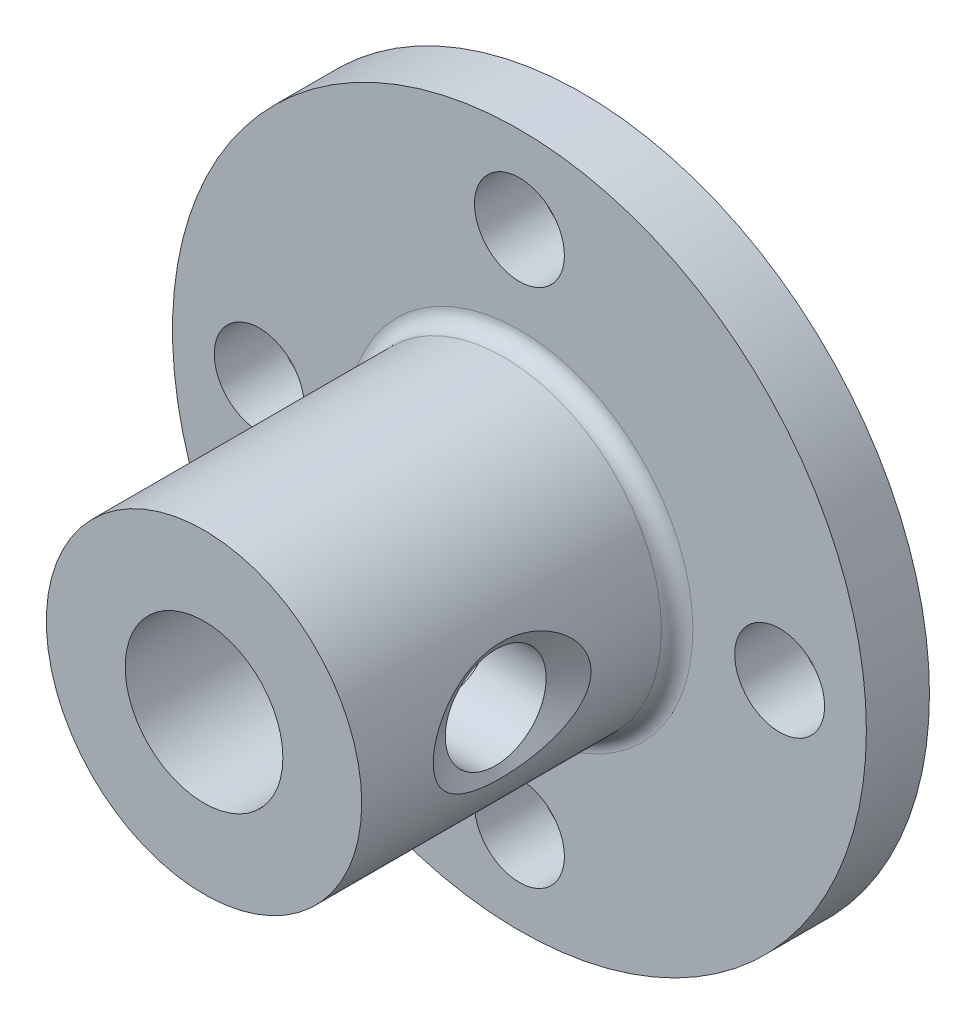
ISO-10303-21;
HEADER;
FILE_DESCRIPTION(('STEP AP214'),'2;1');
FILE_NAME('part.step','',(''),(''),'','','');
FILE_SCHEMA(('AUTOMOTIVE_DESIGN { 1 0 10303 214 1 1 1 1 }'));
ENDSEC;
DATA;
#1=APPLICATION_CONTEXT('core data for automotive mechanical design processes');
#2=APPLICATION_PROTOCOL_DEFINITION('international standard','automotive_design',2000,#1);
#3=PRODUCT_CONTEXT('',#1,'mechanical');
#4=PRODUCT('Part','Part','',(#3));
#5=PRODUCT_RELATED_PRODUCT_CATEGORY('part','',(#4));
#6=PRODUCT_DEFINITION_FORMATION('','',#4);
#7=PRODUCT_DEFINITION_CONTEXT('part definition',#1,'design');
#8=PRODUCT_DEFINITION('design','',#6,#7);
#9=PRODUCT_DEFINITION_SHAPE('','',#8);
#10=(LENGTH_UNIT() NAMED_UNIT(*) SI_UNIT(.MILLI.,.METRE.));
#11=(NAMED_UNIT(*) PLANE_ANGLE_UNIT() SI_UNIT($,.RADIAN.));
#12=(NAMED_UNIT(*) SI_UNIT($,.STERADIAN.) SOLID_ANGLE_UNIT());
#13=UNCERTAINTY_MEASURE_WITH_UNIT(LENGTH_MEASURE(1.E-05),#10,'distance_accuracy_value','');
#14=(GEOMETRIC_REPRESENTATION_CONTEXT(3) GLOBAL_UNCERTAINTY_ASSIGNED_CONTEXT((#13)) GLOBAL_UNIT_ASSIGNED_CONTEXT((#10,
#11,#12)) REPRESENTATION_CONTEXT('',''));
#15=CARTESIAN_POINT('',(0.,0.,0.));
#16=DIRECTION('',(0.,0.,1.));
#17=DIRECTION('',(1.,0.,0.));
#18=AXIS2_PLACEMENT_3D('',#15,#16,#17);
#19=CARTESIAN_POINT('',(0.,0.,12.));
#20=DIRECTION('',(0.,0.,-1.));
#21=DIRECTION('',(-1.,0.,0.));
#22=AXIS2_PLACEMENT_3D('',#19,#20,#21);
#23=CYLINDRICAL_SURFACE('',#22,2.5);
#24=CARTESIAN_POINT('',(-2.5,0.,8.83212387459479));
#25=CARTESIAN_POINT('',(-2.49999528532764,-0.0811257001498167,8.83172341966178));
#26=CARTESIAN_POINT('',(-2.49601279299299,-0.162270470689614,8.82512463907829));
#27=CARTESIAN_POINT('',(-2.48048469101174,-0.321953484441999,8.799897574851));
#28=CARTESIAN_POINT('',(-2.46893076218919,-0.400488760606093,8.78125605947671));
#29=CARTESIAN_POINT('',(-2.43943209795605,-0.552388004803715,8.73304965644872));
#30=CARTESIAN_POINT('',(-2.42151810291221,-0.625774848537303,8.7035372860463));
#31=CARTESIAN_POINT('',(-2.38078230317859,-0.766313801824575,8.63480079092559));
#32=CARTESIAN_POINT('',(-2.35796027221884,-0.833465623727228,8.59557621844331));
#33=CARTESIAN_POINT('',(-2.3070450965382,-0.965911123596261,8.50494480176076));
#34=CARTESIAN_POINT('',(-2.27867165603093,-1.03058784111943,8.45279699232811));
#35=CARTESIAN_POINT('',(-2.22035452830776,-1.150871171846,8.33954738070551));
#36=CARTESIAN_POINT('',(-2.1904086876936,-1.20646489394395,8.27843308211946));
#37=CARTESIAN_POINT('',(-2.12724482174938,-1.3150296728696,8.1388413462037));
#38=CARTESIAN_POINT('',(-2.0941655573832,-1.36650878609703,8.05913065280923));
#39=CARTESIAN_POINT('',(-2.03356450891492,-1.45516526717104,7.89021567888344));
#40=CARTESIAN_POINT('',(-2.00603268966766,-1.49236857182128,7.80102899488721));
#41=CARTESIAN_POINT('',(-1.9675748655886,-1.54251831488213,7.64043197790774));
#42=CARTESIAN_POINT('',(-1.95416704383307,-1.55931502789184,7.57082257586867));
#43=CARTESIAN_POINT('',(-1.93467843197094,-1.58343549358183,7.42902010070153));
#44=CARTESIAN_POINT('',(-1.92858671277118,-1.59077337745315,7.35683104771272));
#45=CARTESIAN_POINT('',(-1.9246594743494,-1.59552444877219,7.2116886257586));
#46=CARTESIAN_POINT('',(-1.92684722502182,-1.59290966359036,7.1387336781318));
#47=CARTESIAN_POINT('',(-1.93917338304728,-1.57787646071465,6.99450502801767));
#48=CARTESIAN_POINT('',(-1.94931856389971,-1.56544969083304,6.92323281116578));
#49=CARTESIAN_POINT('',(-1.97574347158606,-1.53195062989658,6.78592987571592));
#50=CARTESIAN_POINT('',(-1.99186600949792,-1.51109873369579,6.7198133108702));
#51=CARTESIAN_POINT('',(-2.02846896948346,-1.46159476981444,6.59188304187705));
#52=CARTESIAN_POINT('',(-2.04895083381435,-1.43294011976043,6.53007077078407));
#53=CARTESIAN_POINT('',(-2.09680996058701,-1.36218493395521,6.39959180217855));
#54=CARTESIAN_POINT('',(-2.12475128137683,-1.31854863311683,6.33196547226825));
#55=CARTESIAN_POINT('',(-2.18175428088871,-1.22192570728252,6.20420775793231));
#56=CARTESIAN_POINT('',(-2.21081726467822,-1.168927917067,6.14408547117298));
#57=CARTESIAN_POINT('',(-2.2728544731105,-1.04394743226326,6.02208365269237));
#58=CARTESIAN_POINT('',(-2.30559956672106,-0.970264550392063,5.96180997127015));
#59=CARTESIAN_POINT('',(-2.36598348519537,-0.811956490320795,5.85453981443563));
#60=CARTESIAN_POINT('',(-2.39362802231499,-0.727343735647986,5.80752845456604));
#61=CARTESIAN_POINT('',(-2.43594410966984,-0.567096067603944,5.73689474193409));
#62=CARTESIAN_POINT('',(-2.45210753743649,-0.493091038650944,5.71046766194117));
#63=CARTESIAN_POINT('',(-2.47784028608681,-0.340944021843667,5.66861081375687));
#64=CARTESIAN_POINT('',(-2.48741488397657,-0.262805398736681,5.65317224450613));
#65=CARTESIAN_POINT('',(-2.49909190995937,-0.104277753418442,5.63407248080202));
#66=CARTESIAN_POINT('',(-2.50117039381239,-0.0238823451187824,5.63044902996755));
#67=CARTESIAN_POINT('',(-2.49756408255839,0.136370721222933,5.63530404109612));
#68=CARTESIAN_POINT('',(-2.49187865880076,0.216228335193125,5.64378348304382));
#69=CARTESIAN_POINT('',(-2.47375734527055,0.368984213952153,5.67162403183808));
#70=CARTESIAN_POINT('',(-2.46167497799725,0.442030547044343,5.69041699516661));
#71=CARTESIAN_POINT('',(-2.43197449293306,0.5837349513466,5.73760480383412));
#72=CARTESIAN_POINT('',(-2.4143554326288,0.652392273017069,5.76600128404624));
#73=CARTESIAN_POINT('',(-2.37331714411059,0.789210870617883,5.83390513533774));
#74=CARTESIAN_POINT('',(-2.34955543639988,0.856925696974424,5.87410040265875));
#75=CARTESIAN_POINT('',(-2.29881998131915,0.984977120695749,5.96328007368875));
#76=CARTESIAN_POINT('',(-2.27184365854045,1.0453077226384,6.01227154066548));
#77=CARTESIAN_POINT('',(-2.2123134917874,1.16657503415996,6.1261927496278));
#78=CARTESIAN_POINT('',(-2.17953780217481,1.22619202332549,6.19241421575833));
#79=CARTESIAN_POINT('',(-2.11532508241099,1.33391594364428,6.33426281287102));
#80=CARTESIAN_POINT('',(-2.08388823219933,1.38202133163005,6.40989120281895));
#81=CARTESIAN_POINT('',(-2.0302203271573,1.45948579917374,6.55811444738196));
#82=CARTESIAN_POINT('',(-2.00731544730974,1.49054914305566,6.62956899263356));
#83=CARTESIAN_POINT('',(-1.96785238413523,1.54227803497828,6.77778325187809));
#84=CARTESIAN_POINT('',(-1.95128517871595,1.56295837711046,6.85453523936672));
#85=CARTESIAN_POINT('',(-1.92692250102793,1.59291004958125,7.01242224464583));
#86=CARTESIAN_POINT('',(-1.91920875214569,1.60207515865963,7.09359096589892));
#87=CARTESIAN_POINT('',(-1.91436314348674,1.60786666509709,7.25667306804846));
#88=CARTESIAN_POINT('',(-1.9172245996375,1.60450098254987,7.33858594594739));
#89=CARTESIAN_POINT('',(-1.93180423987997,1.58689153945899,7.48863954710057));
#90=CARTESIAN_POINT('',(-1.94223117953252,1.57423082441318,7.5571073973512));
#91=CARTESIAN_POINT('',(-1.96904004052971,1.54056570886488,7.69075518859283));
#92=CARTESIAN_POINT('',(-1.98542764090042,1.5195533495475,7.75593192630584));
#93=CARTESIAN_POINT('',(-2.02890076089363,1.46126520624875,7.90412444748925));
#94=CARTESIAN_POINT('',(-2.05772314680492,1.42087139014034,7.98540246744105));
#95=CARTESIAN_POINT('',(-2.11897947358059,1.3277928750901,8.13911541263695));
#96=CARTESIAN_POINT('',(-2.15141890800696,1.27508934356351,8.21153652643995));
#97=CARTESIAN_POINT('',(-2.21680979707969,1.15772357365444,8.34740746312825));
#98=CARTESIAN_POINT('',(-2.24976274380636,1.09292619418879,8.4107399764446));
#99=CARTESIAN_POINT('',(-2.31263029060745,0.952695922198671,8.52609374476496));
#100=CARTESIAN_POINT('',(-2.34254786741452,0.877273626201766,8.57812613985564));
#101=CARTESIAN_POINT('',(-2.39286369456269,0.727719449138458,8.66309520272136));
#102=CARTESIAN_POINT('',(-2.41399958940981,0.654759652186082,8.6976538597646));
#103=CARTESIAN_POINT('',(-2.45007752841695,0.503149623769568,8.75563945935023));
#104=CARTESIAN_POINT('',(-2.46502969362768,0.424508940198864,8.77908460090545));
#105=CARTESIAN_POINT('',(-2.484014557395,0.287918235005646,8.80847225293373));
#106=CARTESIAN_POINT('',(-2.48998147151682,0.230895303604966,8.81756268129504));
#107=CARTESIAN_POINT('',(-2.49797606447772,0.115918218675103,8.82953184925064));
#108=CARTESIAN_POINT('',(-2.5000033686139,0.0579639770959529,8.83240999798752));
#109=CARTESIAN_POINT('',(-2.5,0.,8.83212387459479));
#110=B_SPLINE_CURVE_WITH_KNOTS('',3,(#24,#25,#26,#27,#28,#29,#30,#31,#32,#33,#34,#35,#36,#37,
#38,#39,#40,#41,#42,#43,#44,#45,#46,#47,#48,#49,#50,#51,#52,#53,#54,#55,#56,#57,#58,#59,#60,#61,
#62,#63,#64,#65,#66,#67,#68,#69,#70,#71,#72,#73,#74,#75,#76,#77,#78,#79,#80,#81,#82,#83,#84,#85,
#86,#87,#88,#89,#90,#91,#92,#93,#94,#95,#96,#97,#98,#99,#100,#101,#102,#103,#104,#105,#106,#107,
#108,#109),.UNSPECIFIED.,.T.,.F.,(4,2,2,2,2,2,2,2,2,2,2,2,2,2,2,2,2,2,2,2,2,2,2,2,2,2,2,2,2,2,2,
2,2,2,2,2,2,2,2,2,2,2,4),(0.,0.243144665339784,0.486556936763848,0.728808381245611,
0.971070996384243,1.2334437480446,1.49618569876053,1.79621607087878,2.09569872651867,
2.31335601731847,2.5306877567105,2.7486307716495,2.96675950497226,3.17951768018675,
3.39234635489934,3.64700259486389,3.90196463349041,4.20248765838711,4.50267204868546,
4.7423280630508,4.98179191237941,5.22201998789947,5.46226751605713,5.69044406504366,
5.91865947767216,6.16447188774905,6.410482572976,6.69413531545825,6.97782606123672,
7.22053079666751,7.46288872883534,7.70746623850406,7.95188918907473,8.16221396747096,
8.37273966018642,8.65692872471713,8.94155545029175,9.22957710072672,9.51731350639453,
9.76663466706735,10.015546127559,10.189255463946,10.3629813213097),.UNSPECIFIED.);
#111=CARTESIAN_POINT('',(-2.5,0.,8.83212387459479));
#112=VERTEX_POINT('',#111);
#113=EDGE_CURVE('E41',#112,#112,#110,.T.);
#114=ORIENTED_EDGE('',*,*,#113,.F.);
#115=EDGE_LOOP('',(#114));
#116=FACE_BOUND('',#115,.T.);
#117=CARTESIAN_POINT('',(1.92591888402043,1.59400014183609,7.23214287927517));
#118=CARTESIAN_POINT('',(1.92593088661887,1.59399277416263,7.15309104712007));
#119=CARTESIAN_POINT('',(1.93087009731857,1.58807538039552,7.07397385388615));
#120=CARTESIAN_POINT('',(1.94972280385169,1.56485954766044,6.9184857173291));
#121=CARTESIAN_POINT('',(1.96365362304423,1.54753913819124,6.84212037626031));
#122=CARTESIAN_POINT('',(1.99809032627638,1.50280266236082,6.694824671056));
#123=CARTESIAN_POINT('',(2.01853789389167,1.47547582907761,6.6238527672222));
#124=CARTESIAN_POINT('',(2.06359653594062,1.41176827142799,6.487580154387));
#125=CARTESIAN_POINT('',(2.08820848452979,1.37538564538087,6.42228064045542));
#126=CARTESIAN_POINT('',(2.14300360151862,1.28861307585258,6.28906641955012));
#127=CARTESIAN_POINT('',(2.17348226036054,1.23696942448552,6.22208968124221));
#128=CARTESIAN_POINT('',(2.23414734193041,1.1237087221977,6.0969337200801));
#129=CARTESIAN_POINT('',(2.26433348495683,1.06208296522801,6.03876226334717));
#130=CARTESIAN_POINT('',(2.32558978465042,0.921017909867726,5.92542827650293));
#131=CARTESIAN_POINT('',(2.35627288974228,0.840306524414028,5.87161869699955));
#132=CARTESIAN_POINT('',(2.41060122997785,0.668637206552424,5.77877020240003));
#133=CARTESIAN_POINT('',(2.43425370921379,0.577689954978507,5.73971607251479));
#134=CARTESIAN_POINT('',(2.46958706628174,0.398244881008467,5.68194262284464));
#135=CARTESIAN_POINT('',(2.48226719679922,0.310499727378442,5.66151351737415));
#136=CARTESIAN_POINT('',(2.49811264199053,0.132012115252672,5.6357239910556));
#137=CARTESIAN_POINT('',(2.5012886371198,0.0412731371963532,5.63034665592998));
#138=CARTESIAN_POINT('',(2.49799471367084,-0.126828431536087,5.63467956511512));
#139=CARTESIAN_POINT('',(2.4928174914804,-0.204279000016695,5.64237593661844));
#140=CARTESIAN_POINT('',(2.47563523643761,-0.35650392626902,5.66871022573041));
#141=CARTESIAN_POINT('',(2.4636296914628,-0.431278082863373,5.68734896401714));
#142=CARTESIAN_POINT('',(2.43379117413152,-0.576327431441053,5.73468542606283));
#143=CARTESIAN_POINT('',(2.41595594521805,-0.646600868666379,5.7633870452798));
#144=CARTESIAN_POINT('',(2.37580206040093,-0.781354039179993,5.82976152453588));
#145=CARTESIAN_POINT('',(2.35348246291189,-0.8458325515826,5.86743626897572));
#146=CARTESIAN_POINT('',(2.30281460562983,-0.975970610380536,5.95604173423661));
#147=CARTESIAN_POINT('',(2.27406064276198,-1.04073779271647,6.00804888452436));
#148=CARTESIAN_POINT('',(2.21498398449537,-1.1611882670592,6.12106254600643));
#149=CARTESIAN_POINT('',(2.18465898408566,-1.21685768352723,6.18208253831561));
#150=CARTESIAN_POINT('',(2.12076795308351,-1.32545697192836,6.32135129096244));
#151=CARTESIAN_POINT('',(2.08733993821451,-1.37692131092707,6.40081600042194));
#152=CARTESIAN_POINT('',(2.02603536969152,-1.46563801853169,6.5692421066396));
#153=CARTESIAN_POINT('',(1.99814881914005,-1.50291609269455,6.65818594906187));
#154=CARTESIAN_POINT('',(1.95902927314136,-1.55336227779484,6.81855160639412));
#155=CARTESIAN_POINT('',(1.94533032817602,-1.57032862272537,6.8881725721193));
#156=CARTESIAN_POINT('',(1.92530300899577,-1.59482501398055,7.0300499533853));
#157=CARTESIAN_POINT('',(1.9189636139231,-1.60236917123178,7.10230226072464));
#158=CARTESIAN_POINT('',(1.91461797448318,-1.60756108088268,7.24763673629108));
#159=CARTESIAN_POINT('',(1.91663628165172,-1.60517967587664,7.32072071965741));
#160=CARTESIAN_POINT('',(1.92873195231393,-1.5906211836346,7.46524742637358));
#161=CARTESIAN_POINT('',(1.9388160607966,-1.57843589789844,7.53668872457544));
#162=CARTESIAN_POINT('',(1.96519901237687,-1.54545064715413,7.67416768493574));
#163=CARTESIAN_POINT('',(1.98132189442465,-1.52489327533759,7.74029934917399));
#164=CARTESIAN_POINT('',(2.01800446698602,-1.47600470092555,7.86828407314231));
#165=CARTESIAN_POINT('',(2.03856562994608,-1.44767091757464,7.93013570391135));
#166=CARTESIAN_POINT('',(2.08664945555008,-1.37768846318493,8.06063074353663));
#167=CARTESIAN_POINT('',(2.1147477690898,-1.33452077404642,8.12824658643002));
#168=CARTESIAN_POINT('',(2.17216910719605,-1.23887070942507,8.25603041214461));
#169=CARTESIAN_POINT('',(2.2014935565605,-1.18637725344846,8.31618938905608));
#170=CARTESIAN_POINT('',(2.26427193802071,-1.06241562247167,8.43843376731931));
#171=CARTESIAN_POINT('',(2.29751600335838,-0.98923276124616,8.49890738269512));
#172=CARTESIAN_POINT('',(2.35904315454437,-0.831881418396844,8.6066411746301));
#173=CARTESIAN_POINT('',(2.38733166038977,-0.747725116678817,8.65391582121515));
#174=CARTESIAN_POINT('',(2.43096604842164,-0.588067334230365,8.72515645953181));
#175=CARTESIAN_POINT('',(2.44776885326855,-0.514200191779012,8.75189302925012));
#176=CARTESIAN_POINT('',(2.47481916666244,-0.36222847666837,8.79436611756467));
#177=CARTESIAN_POINT('',(2.48507194191519,-0.284127363395779,8.81011147485105));
#178=CARTESIAN_POINT('',(2.49811557774033,-0.125558115971941,8.82980876466871));
#179=CARTESIAN_POINT('',(2.50088199271457,-0.0450830926966786,8.83372206624465));
#180=CARTESIAN_POINT('',(2.49862304268282,0.115435072129011,8.82940928734508));
#181=CARTESIAN_POINT('',(2.49359710022963,0.195478181231649,8.82118230722467));
#182=CARTESIAN_POINT('',(2.47671775042529,0.348567635697238,8.79380543277025));
#183=CARTESIAN_POINT('',(2.46523041148253,0.42176182729074,8.77524168955235));
#184=CARTESIAN_POINT('',(2.43666813229433,0.563829704915874,8.72849209325225));
#185=CARTESIAN_POINT('',(2.41959228830192,0.632702689993926,8.70030468384379));
#186=CARTESIAN_POINT('',(2.37964235472276,0.7699284937459,8.63285826669699));
#187=CARTESIAN_POINT('',(2.35642714788436,0.837847113288379,8.59292257554284));
#188=CARTESIAN_POINT('',(2.3067077086386,0.966362775706655,8.50426256534316));
#189=CARTESIAN_POINT('',(2.28020088461088,1.02695397438021,8.45553130733612));
#190=CARTESIAN_POINT('',(2.22158968127454,1.14881537704597,8.34218757896783));
#191=CARTESIAN_POINT('',(2.18924876594084,1.20877541983911,8.27628627122594));
#192=CARTESIAN_POINT('',(2.12575044213844,1.31724552914111,8.13507395549687));
#193=CARTESIAN_POINT('',(2.0945934078921,1.36575200005183,8.05976000393341));
#194=CARTESIAN_POINT('',(2.04114344517803,1.44418228097976,7.91178756655802));
#195=CARTESIAN_POINT('',(2.01822020364944,1.47575752690067,7.84023564796615));
#196=CARTESIAN_POINT('',(1.97866229512522,1.52839463755359,7.6918015361609));
#197=CARTESIAN_POINT('',(1.96201137119639,1.54948372696426,7.61493374229905));
#198=CARTESIAN_POINT('',(1.94201169397045,1.57440161022289,7.48658436500302));
#199=CARTESIAN_POINT('',(1.9360225713871,1.58172639877425,7.43617353999536));
#200=CARTESIAN_POINT('',(1.9279722289324,1.59152811176804,7.33456526428265));
#201=CARTESIAN_POINT('',(1.92591110643874,1.59400491602583,7.28336779410788));
#202=CARTESIAN_POINT('',(1.92591888402043,1.59400014183609,7.23214287927517));
#203=B_SPLINE_CURVE_WITH_KNOTS('',3,(#117,#118,#119,#120,#121,#122,#123,#124,#125,#126,#127,
#128,#129,#130,#131,#132,#133,#134,#135,#136,#137,#138,#139,#140,#141,#142,#143,#144,#145,#146,
#147,#148,#149,#150,#151,#152,#153,#154,#155,#156,#157,#158,#159,#160,#161,#162,#163,#164,#165,
#166,#167,#168,#169,#170,#171,#172,#173,#174,#175,#176,#177,#178,#179,#180,#181,#182,#183,#184,
#185,#186,#187,#188,#189,#190,#191,#192,#193,#194,#195,#196,#197,#198,#199,#200,#201,#202),
.UNSPECIFIED.,.T.,.F.,(4,2,2,2,2,2,2,2,2,2,2,2,2,2,2,2,2,2,2,2,2,2,2,2,2,2,2,2,2,2,2,2,2,2,2,2,
2,2,2,2,2,2,4),(0.,0.23692412468913,0.474306078762228,0.709620757721981,0.944984893587536,
1.21366158828906,1.48257388793403,1.78612760550098,2.08936745985237,2.36063693064251,
2.63160144244017,2.86449109266467,3.09739821185698,3.3303955918298,3.56344194561727,
3.82612168285743,4.0891983832231,4.388974653469,4.68820511199489,4.90617672102729,
5.1238214968287,5.34210607748187,5.56057338868967,5.77311584568291,5.98572892454861,
6.23980222154461,6.4941794419664,6.79446546601536,7.09442098222544,7.33439678655725,
7.57417938901362,7.81474402652676,8.05532649176611,8.28348215136487,8.51167472547853,
8.75714453258708,9.00280884795349,9.28600019678804,9.56928032950167,9.81286777208524,
10.0558194550334,10.209340466752,10.3628652843072),.UNSPECIFIED.);
#204=CARTESIAN_POINT('',(1.92591888402043,1.59400014183609,7.23214287927517));
#205=VERTEX_POINT('',#204);
#206=EDGE_CURVE('E84',#205,#205,#203,.T.);
#207=ORIENTED_EDGE('',*,*,#206,.F.);
#208=EDGE_LOOP('',(#207));
#209=FACE_BOUND('',#208,.T.);
#210=CARTESIAN_POINT('',(0.,0.,12.));
#211=DIRECTION('',(0.,0.,1.));
#212=DIRECTION('',(1.,0.,0.));
#213=AXIS2_PLACEMENT_3D('',#210,#211,#212);
#214=CIRCLE('',#213,2.5);
#215=CARTESIAN_POINT('',(2.5,0.,12.));
#216=VERTEX_POINT('',#215);
#217=EDGE_CURVE('E107',#216,#216,#214,.T.);
#218=ORIENTED_EDGE('',*,*,#217,.T.);
#219=EDGE_LOOP('',(#218));
#220=FACE_BOUND('',#219,.T.);
#221=CARTESIAN_POINT('',(0.,0.,0.));
#222=DIRECTION('',(0.,0.,1.));
#223=DIRECTION('',(1.,0.,0.));
#224=AXIS2_PLACEMENT_3D('',#221,#222,#223);
#225=CIRCLE('',#224,2.5);
#226=CARTESIAN_POINT('',(2.5,0.,0.));
#227=VERTEX_POINT('',#226);
#228=EDGE_CURVE('E110',#227,#227,#225,.T.);
#229=ORIENTED_EDGE('',*,*,#228,.F.);
#230=EDGE_LOOP('',(#229));
#231=FACE_BOUND('',#230,.T.);
#232=ADVANCED_FACE('F37',(#116,#209,#220,#231),#23,.F.);
#233=CARTESIAN_POINT('',(0.,0.,12.));
#234=DIRECTION('',(0.,0.,-1.));
#235=DIRECTION('',(-1.,0.,0.));
#236=AXIS2_PLACEMENT_3D('',#233,#234,#235);
#237=CYLINDRICAL_SURFACE('',#236,5.);
#238=CARTESIAN_POINT('',(-5.,0.,8.83206685919916));
#239=CARTESIAN_POINT('',(-4.99999975101783,-0.0875813553801603,8.83121278367281));
#240=CARTESIAN_POINT('',(-4.99767728198553,-0.175095815657853,8.82314431601266));
#241=CARTESIAN_POINT('',(-4.98866237735372,-0.347417544875031,8.79288044282452));
#242=CARTESIAN_POINT('',(-4.98196906636776,-0.432224267942964,8.77068220742784));
#243=CARTESIAN_POINT('',(-4.96496368807344,-0.59662400811406,8.71298643463724));
#244=CARTESIAN_POINT('',(-4.9546575180997,-0.67622527243585,8.67751056421841));
#245=CARTESIAN_POINT('',(-4.93150532595554,-0.828362453210553,8.59435228411047));
#246=CARTESIAN_POINT('',(-4.91865887193219,-0.900897165202697,8.54666779852761));
#247=CARTESIAN_POINT('',(-4.89133669585424,-1.03920371622212,8.43880389875657));
#248=CARTESIAN_POINT('',(-4.87682415107749,-1.10471369980698,8.37829805956541));
#249=CARTESIAN_POINT('',(-4.84804947656018,-1.22484268063318,8.24722920929307));
#250=CARTESIAN_POINT('',(-4.83378739465001,-1.27945961784028,8.17666430021328));
#251=CARTESIAN_POINT('',(-4.80676774658191,-1.37754969483062,8.02534029383384));
#252=CARTESIAN_POINT('',(-4.7940558432003,-1.42071551452073,7.94437305905209));
#253=CARTESIAN_POINT('',(-4.77213762718798,-1.4926918540543,7.77584925099364));
#254=CARTESIAN_POINT('',(-4.76293028877422,-1.52150657521457,7.68829461484374));
#255=CARTESIAN_POINT('',(-4.74946828680806,-1.56301503255834,7.51212821623283));
#256=CARTESIAN_POINT('',(-4.74506055641171,-1.5762082541868,7.42364614438562));
#257=CARTESIAN_POINT('',(-4.74124746623941,-1.58764384367492,7.24562453369103));
#258=CARTESIAN_POINT('',(-4.74184076849383,-1.58589021039489,7.15608528408087));
#259=CARTESIAN_POINT('',(-4.74782008562478,-1.56789127744102,6.98234355231598));
#260=CARTESIAN_POINT('',(-4.75301051084626,-1.55223731331629,6.89807200132726));
#261=CARTESIAN_POINT('',(-4.76728869892721,-1.50781219144616,6.73341264521238));
#262=CARTESIAN_POINT('',(-4.7763769253065,-1.47903947361551,6.65302530325508));
#263=CARTESIAN_POINT('',(-4.79759894301103,-1.40869081379104,6.49683115553348));
#264=CARTESIAN_POINT('',(-4.80978212464148,-1.36690448565731,6.42112609894312));
#265=CARTESIAN_POINT('',(-4.83577924362247,-1.27187286169719,6.27759262173883));
#266=CARTESIAN_POINT('',(-4.84959362388205,-1.21862445039905,6.2097663503645));
#267=CARTESIAN_POINT('',(-4.87808715575997,-1.09918358188982,6.08052506550291));
#268=CARTESIAN_POINT('',(-4.89277614591022,-1.03249520843136,6.01956960544611));
#269=CARTESIAN_POINT('',(-4.92075575161846,-0.889636861841464,5.90959726512183));
#270=CARTESIAN_POINT('',(-4.93404627333443,-0.813466253167236,5.86058118573794));
#271=CARTESIAN_POINT('',(-4.95783452481052,-0.653058360034233,5.77565360253937));
#272=CARTESIAN_POINT('',(-4.9683132775038,-0.568771235107467,5.73983056517496));
#273=CARTESIAN_POINT('',(-4.98513997165486,-0.39495508877566,5.68300277881147));
#274=CARTESIAN_POINT('',(-4.99148924802482,-0.305427771548591,5.6619932409523));
#275=CARTESIAN_POINT('',(-4.99913074760866,-0.127614653287088,5.63613899731125));
#276=CARTESIAN_POINT('',(-5.00061952086165,-0.0394282895888853,5.63066721976496));
#277=CARTESIAN_POINT('',(-4.9989084506802,0.136589739329515,5.6342985958663));
#278=CARTESIAN_POINT('',(-4.9957092803428,0.224421453654851,5.64339965715662));
#279=CARTESIAN_POINT('',(-4.98509000978899,0.394973181647469,5.67541998742057));
#280=CARTESIAN_POINT('',(-4.97777682154171,0.47776599089759,5.69799010296385));
#281=CARTESIAN_POINT('',(-4.95974122276303,0.638359056589122,5.75589495940608));
#282=CARTESIAN_POINT('',(-4.94901836216295,0.716158652307876,5.79123138551177));
#283=CARTESIAN_POINT('',(-4.92489200485461,0.866844285753397,5.8747163652246));
#284=CARTESIAN_POINT('',(-4.91142504555637,0.939545668204403,5.92317939663228));
#285=CARTESIAN_POINT('',(-4.88335031562074,1.07598791603553,6.03114773771302));
#286=CARTESIAN_POINT('',(-4.86874222134676,1.13972622494716,6.09065618660299));
#287=CARTESIAN_POINT('',(-4.8392641116993,1.25915260014348,6.22192789607261));
#288=CARTESIAN_POINT('',(-4.8244080246743,1.31440189112149,6.29409444172104));
#289=CARTESIAN_POINT('',(-4.79674018391555,1.41204399113507,6.44702146417655));
#290=CARTESIAN_POINT('',(-4.78392837502481,1.4544371470719,6.52778170901762));
#291=CARTESIAN_POINT('',(-4.76195581532687,1.52484044455489,6.69532247366935));
#292=CARTESIAN_POINT('',(-4.75277614113688,1.55292535833124,6.78206894915777));
#293=CARTESIAN_POINT('',(-4.73916110957028,1.59399809491746,6.9594139494459));
#294=CARTESIAN_POINT('',(-4.73472384144736,1.60699199817683,7.05001090755158));
#295=CARTESIAN_POINT('',(-4.7312737148613,1.61711882942293,7.22784042160835));
#296=CARTESIAN_POINT('',(-4.73201229365017,1.6149785110002,7.31502741542711));
#297=CARTESIAN_POINT('',(-4.73823513137138,1.59662758393587,7.48772727584313));
#298=CARTESIAN_POINT('',(-4.74371920916987,1.58041751233126,7.57324020621135));
#299=CARTESIAN_POINT('',(-4.7586547900353,1.5348495279007,7.73898907894957));
#300=CARTESIAN_POINT('',(-4.76804912913721,1.50568066125804,7.81928251837422));
#301=CARTESIAN_POINT('',(-4.78974485919225,1.43516514880686,7.97390416200723));
#302=CARTESIAN_POINT('',(-4.80204687562292,1.39381588237091,8.04823107812739));
#303=CARTESIAN_POINT('',(-4.82882297209981,1.29808856344434,8.19216582009226));
#304=CARTESIAN_POINT('',(-4.84336632868486,1.24323833175114,8.26144672308164));
#305=CARTESIAN_POINT('',(-4.87266722806485,1.12291718324822,8.39004473378942));
#306=CARTESIAN_POINT('',(-4.88742482717891,1.05744342599651,8.44935916808732));
#307=CARTESIAN_POINT('',(-4.91610067332768,0.915091213182028,8.55832203017211));
#308=CARTESIAN_POINT('',(-4.92997434894851,0.837904595473132,8.6075808915658));
#309=CARTESIAN_POINT('',(-4.95478268326731,0.675891436999891,8.6923433279541));
#310=CARTESIAN_POINT('',(-4.9657184192029,0.591067711763393,8.72785194678559));
#311=CARTESIAN_POINT('',(-4.9827670784475,0.422676980972181,8.78181276731216));
#312=CARTESIAN_POINT('',(-4.98917708249479,0.339481743343816,8.80133298113585));
#313=CARTESIAN_POINT('',(-4.99779321142678,0.170836148992068,8.82687490660895));
#314=CARTESIAN_POINT('',(-5.00000024274187,0.0853862825424231,8.83289952882261));
#315=CARTESIAN_POINT('',(-5.,0.,8.83206685919916));
#316=B_SPLINE_CURVE_WITH_KNOTS('',3,(#238,#239,#240,#241,#242,#243,#244,#245,#246,#247,#248,
#249,#250,#251,#252,#253,#254,#255,#256,#257,#258,#259,#260,#261,#262,#263,#264,#265,#266,#267,
#268,#269,#270,#271,#272,#273,#274,#275,#276,#277,#278,#279,#280,#281,#282,#283,#284,#285,#286,
#287,#288,#289,#290,#291,#292,#293,#294,#295,#296,#297,#298,#299,#300,#301,#302,#303,#304,#305,
#306,#307,#308,#309,#310,#311,#312,#313,#314,#315),.UNSPECIFIED.,.T.,.F.,(4,2,2,2,2,2,2,2,2,2,2,
2,2,2,2,2,2,2,2,2,2,2,2,2,2,2,2,2,2,2,2,2,2,2,2,2,2,2,4),(0.,0.262441867807553,
0.524936313252254,0.787004264270472,1.04911680568095,1.31894331849353,1.58882081115794,
1.86533984016051,2.14177786993363,2.40911536748628,2.67638134419044,2.9327948013747,
3.18923875926357,3.45006496757428,3.71096215993394,3.98429223656679,4.25764064290517,
4.53278999026717,4.807850347407,5.07164026359129,5.33539230841275,5.59258732671413,
5.84981630825287,6.11385648344992,6.37797181670394,6.65294711802351,6.92791499893513,
7.20143081724117,7.47483639264976,7.73520519739978,7.99556406441122,8.25224347251362,
8.50897814587984,8.77643958258643,9.04397264941054,9.32045217391915,9.59683018446534,
9.85274960671918,10.1086138300839),.UNSPECIFIED.);
#317=CARTESIAN_POINT('',(-5.,0.,8.83206685919916));
#318=VERTEX_POINT('',#317);
#319=EDGE_CURVE('E63',#318,#318,#316,.T.);
#320=ORIENTED_EDGE('',*,*,#319,.T.);
#321=EDGE_LOOP('',(#320));
#322=FACE_BOUND('',#321,.T.);
#323=CARTESIAN_POINT('',(4.79357561735534,-1.42184134159764,5.60621794532255));
#324=CARTESIAN_POINT('',(4.76877501382219,-1.50546598120846,5.73484998070902));
#325=CARTESIAN_POINT('',(4.74504414260906,-1.57756758557567,5.87117531529028));
#326=CARTESIAN_POINT('',(4.70275633248481,-1.69948385861899,6.15455046008612));
#327=CARTESIAN_POINT('',(4.68421513381097,-1.74923099679333,6.30163122586039));
#328=CARTESIAN_POINT('',(4.65448542132471,-1.82689444405751,6.60522636157734));
#329=CARTESIAN_POINT('',(4.6434452184481,-1.85437236646546,6.76186777951642));
#330=CARTESIAN_POINT('',(4.63086913344544,-1.88555989178326,7.07767889015137));
#331=CARTESIAN_POINT('',(4.62932193016737,-1.88929780671467,7.23684534422368));
#332=CARTESIAN_POINT('',(4.63608150818121,-1.87265648908469,7.56087316276978));
#333=CARTESIAN_POINT('',(4.64483268286591,-1.85118972317825,7.72567035183577));
#334=CARTESIAN_POINT('',(4.67159917066774,-1.78255455468829,8.04936207325339));
#335=CARTESIAN_POINT('',(4.68963125070068,-1.73533962615961,8.2082453625476));
#336=CARTESIAN_POINT('',(4.73233961138548,-1.61525213064341,8.51541968242348));
#337=CARTESIAN_POINT('',(4.75702814736464,-1.54233216071103,8.66369053059121));
#338=CARTESIAN_POINT('',(4.80941868740384,-1.37024315669442,8.94348534118839));
#339=CARTESIAN_POINT('',(4.83711186275037,-1.27114986114597,9.07505602850318));
#340=CARTESIAN_POINT('',(4.87979343059651,-1.09190859223411,9.26403844829315));
#341=CARTESIAN_POINT('',(4.89534158054903,-1.02061309993939,9.32975860086233));
#342=CARTESIAN_POINT('',(4.92459963399814,-0.868501666318717,9.44957709843444));
#343=CARTESIAN_POINT('',(4.93831265135288,-0.787702300535725,9.50369522620882));
#344=CARTESIAN_POINT('',(4.9603060205402,-0.632717123842738,9.58851053977353));
#345=CARTESIAN_POINT('',(4.96912007241077,-0.5599643440329,9.62167103995505));
#346=CARTESIAN_POINT('',(4.98375157518078,-0.409750043562008,9.67583583021744));
#347=CARTESIAN_POINT('',(4.98957119100428,-0.332291970172752,9.69684890403301));
#348=CARTESIAN_POINT('',(4.99759323054498,-0.174212615663939,9.7251210524498));
#349=CARTESIAN_POINT('',(4.99977475730206,-0.0935757652801941,9.73230070507016));
#350=CARTESIAN_POINT('',(5.00019169672268,0.0676736562554465,9.73197982894662));
#351=CARTESIAN_POINT('',(4.99842764244578,0.148286229215668,9.72448128328742));
#352=CARTESIAN_POINT('',(4.99154204779001,0.299545697552319,9.69684440989858));
#353=CARTESIAN_POINT('',(4.98673873826199,0.370434337258736,9.67791113212129));
#354=CARTESIAN_POINT('',(4.9745704504863,0.508382625084936,9.62980368644832));
#355=CARTESIAN_POINT('',(4.96720441391602,0.575440677957322,9.60062528760614));
#356=CARTESIAN_POINT('',(4.9472852111927,0.729752657713163,9.52061430970291));
#357=CARTESIAN_POINT('',(4.93382735256409,0.814808943158264,9.46577073342815));
#358=CARTESIAN_POINT('',(4.90474531854554,0.974740705434935,9.34327793708781));
#359=CARTESIAN_POINT('',(4.88911631541042,1.04959273616131,9.27560005276795));
#360=CARTESIAN_POINT('',(4.85131668673979,1.21417414459524,9.10436207902124));
#361=CARTESIAN_POINT('',(4.82882140771082,1.29951875214445,8.99666859544256));
#362=CARTESIAN_POINT('',(4.78525566907929,1.45175767206954,8.76879996109245));
#363=CARTESIAN_POINT('',(4.76418660700588,1.51863407976684,8.64861285217134));
#364=CARTESIAN_POINT('',(4.72525618882435,1.63580366100615,8.39641844459762));
#365=CARTESIAN_POINT('',(4.70748238915257,1.68566765929194,8.26419895352631));
#366=CARTESIAN_POINT('',(4.677699397773,1.76663053864358,7.99361174794213));
#367=CARTESIAN_POINT('',(4.66568795801029,1.79773673886088,7.85524645413117));
#368=CARTESIAN_POINT('',(4.6474553641206,1.84443114575172,7.5530713632834));
#369=CARTESIAN_POINT('',(4.64244102248083,1.85681188077532,7.38868048860616));
#370=CARTESIAN_POINT('',(4.6427614872078,1.85600569388066,7.05988657199251));
#371=CARTESIAN_POINT('',(4.64810298267731,1.84280224648092,6.89548359082723));
#372=CARTESIAN_POINT('',(4.66838914596871,1.79078748145613,6.56984331139769));
#373=CARTESIAN_POINT('',(4.68342167942185,1.75174177289348,6.40864903200219));
#374=CARTESIAN_POINT('',(4.7209006135097,1.64807031171162,6.09552344562481));
#375=CARTESIAN_POINT('',(4.74334653897908,1.58344619850135,5.94359154570488));
#376=CARTESIAN_POINT('',(4.78709161666882,1.44492983969982,5.68516606637221));
#377=CARTESIAN_POINT('',(4.80761407059895,1.37595505536901,5.57589311805283));
#378=CARTESIAN_POINT('',(4.84916130534226,1.2214839426875,5.36981320145822));
#379=CARTESIAN_POINT('',(4.87018513339516,1.13601705451669,5.27298452446042));
#380=CARTESIAN_POINT('',(4.90471767278326,0.973954230867047,5.12103263148676));
#381=CARTESIAN_POINT('',(4.91870530109166,0.90136158138732,5.06175685333784));
#382=CARTESIAN_POINT('',(4.94442537326793,0.747472361352634,4.95517563785628));
#383=CARTESIAN_POINT('',(4.95616103543953,0.666188474339902,4.90785308698414));
#384=CARTESIAN_POINT('',(4.97431265654974,0.511063389867208,4.83542813873314));
#385=CARTESIAN_POINT('',(4.98130189378951,0.438439704567684,4.80787835544869));
#386=CARTESIAN_POINT('',(4.9921716690105,0.289451166455454,4.76490463641497));
#387=CARTESIAN_POINT('',(4.99605453750702,0.213089164000794,4.74947161037837));
#388=CARTESIAN_POINT('',(5.00025912240003,0.0584126933554532,4.73193487994195));
#389=CARTESIAN_POINT('',(5.00056649195639,-0.0199083778745859,4.72988488995281));
#390=CARTESIAN_POINT('',(4.99752153594222,-0.175631356978923,4.73944340569166));
#391=CARTESIAN_POINT('',(4.99416893997994,-0.253033196514937,4.75105292056452));
#392=CARTESIAN_POINT('',(4.98448043080556,-0.400093826022417,4.78586972312059));
#393=CARTESIAN_POINT('',(4.97833170443515,-0.469940223892289,4.80835424559343));
#394=CARTESIAN_POINT('',(4.96368047466986,-0.605417319382669,4.86310262427296));
#395=CARTESIAN_POINT('',(4.95517617895778,-0.671044759826123,4.89537392887575));
#396=CARTESIAN_POINT('',(4.93227924575047,-0.825293062250597,4.98426757162053));
#397=CARTESIAN_POINT('',(4.9169476047925,-0.911208483086247,5.04534273054885));
#398=CARTESIAN_POINT('',(4.88447287383742,-1.07175814710451,5.18029757374669));
#399=CARTESIAN_POINT('',(4.86732812322443,-1.14638189359636,5.25418903673178));
#400=CARTESIAN_POINT('',(4.83113654972551,-1.29079352514119,5.41875750531212));
#401=CARTESIAN_POINT('',(4.81205899672577,-1.35951761884727,5.510351136837));
#402=CARTESIAN_POINT('',(4.79357561735534,-1.42184134159764,5.60621794532255));
#403=B_SPLINE_CURVE_WITH_KNOTS('',3,(#323,#324,#325,#326,#327,#328,#329,#330,#331,#332,#333,
#334,#335,#336,#337,#338,#339,#340,#341,#342,#343,#344,#345,#346,#347,#348,#349,#350,#351,#352,
#353,#354,#355,#356,#357,#358,#359,#360,#361,#362,#363,#364,#365,#366,#367,#368,#369,#370,#371,
#372,#373,#374,#375,#376,#377,#378,#379,#380,#381,#382,#383,#384,#385,#386,#387,#388,#389,#390,
#391,#392,#393,#394,#395,#396,#397,#398,#399,#400,#401,#402),.UNSPECIFIED.,.T.,.F.,(4,2,2,2,2,2,
2,2,2,2,2,2,2,2,2,2,2,2,2,2,2,2,2,2,2,2,2,2,2,2,2,2,2,2,2,2,2,2,2,4),(0.,0.465779246561119,
0.932956256882395,1.40912069544414,1.8847171597423,2.38161223476085,2.87940816966099,
3.37812693961246,3.87541806929114,4.16911956007585,4.46231620158668,4.70266482665975,
4.94283943892089,5.18438890699793,5.42590574300479,5.64556988292198,5.86532484484568,
6.16991821631009,6.4752000565585,6.89069410435747,7.30658956524342,7.73231202903644,
8.15786827146534,8.65031104792569,9.14307201187555,9.64036474622549,10.1376256125141,
10.5288157083507,10.919313842071,11.2026365457283,11.4855512847897,11.718545275706,
11.9513643013628,12.185117202433,12.4188873739208,12.6388996517422,12.859079795641,
13.176876155246,13.4949661456333,13.8421018314869),.UNSPECIFIED.);
#404=CARTESIAN_POINT('',(4.79357561735534,-1.42184134159764,5.60621794532255));
#405=VERTEX_POINT('',#404);
#406=EDGE_CURVE('E11',#405,#405,#403,.T.);
#407=ORIENTED_EDGE('',*,*,#406,.T.);
#408=EDGE_LOOP('',(#407));
#409=FACE_BOUND('',#408,.T.);
#410=CARTESIAN_POINT('',(0.,0.,2.5));
#411=DIRECTION('',(0.,0.,1.));
#412=DIRECTION('',(1.,0.,0.));
#413=AXIS2_PLACEMENT_3D('',#410,#411,#412);
#414=CIRCLE('',#413,5.);
#415=CARTESIAN_POINT('',(5.,0.,2.5));
#416=VERTEX_POINT('',#415);
#417=EDGE_CURVE('E54',#416,#416,#414,.T.);
#418=ORIENTED_EDGE('',*,*,#417,.T.);
#419=EDGE_LOOP('',(#418));
#420=FACE_BOUND('',#419,.T.);
#421=CARTESIAN_POINT('',(0.,0.,12.));
#422=DIRECTION('',(0.,0.,1.));
#423=DIRECTION('',(1.,0.,0.));
#424=AXIS2_PLACEMENT_3D('',#421,#422,#423);
#425=CIRCLE('',#424,5.);
#426=CARTESIAN_POINT('',(5.,0.,12.));
#427=VERTEX_POINT('',#426);
#428=EDGE_CURVE('E114',#427,#427,#425,.T.);
#429=ORIENTED_EDGE('',*,*,#428,.F.);
#430=EDGE_LOOP('',(#429));
#431=FACE_BOUND('',#430,.T.);
#432=ADVANCED_FACE('F67',(#322,#409,#420,#431),#237,.T.);
#433=CARTESIAN_POINT('',(0.,0.,12.));
#434=DIRECTION('',(0.,0.,1.));
#435=DIRECTION('',(1.,0.,0.));
#436=AXIS2_PLACEMENT_3D('',#433,#434,#435);
#437=PLANE('',#436);
#438=ORIENTED_EDGE('',*,*,#217,.F.);
#439=EDGE_LOOP('',(#438));
#440=FACE_BOUND('',#439,.T.);
#441=ORIENTED_EDGE('',*,*,#428,.T.);
#442=EDGE_LOOP('',(#441));
#443=FACE_BOUND('',#442,.T.);
#444=ADVANCED_FACE('F97',(#440,#443),#437,.T.);
#445=CARTESIAN_POINT('',(0.,0.,0.));
#446=DIRECTION('',(0.,0.,1.));
#447=DIRECTION('',(1.,0.,0.));
#448=AXIS2_PLACEMENT_3D('',#445,#446,#447);
#449=PLANE('',#448);
#450=CARTESIAN_POINT('',(-8.25,0.,0.));
#451=DIRECTION('',(0.,0.,1.));
#452=DIRECTION('',(0.,1.,0.));
#453=AXIS2_PLACEMENT_3D('',#450,#451,#452);
#454=CIRCLE('',#453,1.425);
#455=CARTESIAN_POINT('',(-8.25000000000001,1.42499999999997,0.));
#456=VERTEX_POINT('',#455);
#457=EDGE_CURVE('E182',#456,#456,#454,.T.);
#458=ORIENTED_EDGE('',*,*,#457,.T.);
#459=EDGE_LOOP('',(#458));
#460=FACE_BOUND('',#459,.T.);
#461=CARTESIAN_POINT('',(0.,-8.25,0.));
#462=DIRECTION('',(0.,0.,1.));
#463=DIRECTION('',(-1.,0.,0.));
#464=AXIS2_PLACEMENT_3D('',#461,#462,#463);
#465=CIRCLE('',#464,1.425);
#466=CARTESIAN_POINT('',(-1.425,-8.25,0.));
#467=VERTEX_POINT('',#466);
#468=EDGE_CURVE('E161',#467,#467,#465,.T.);
#469=ORIENTED_EDGE('',*,*,#468,.T.);
#470=EDGE_LOOP('',(#469));
#471=FACE_BOUND('',#470,.T.);
#472=CARTESIAN_POINT('',(8.25,0.,0.));
#473=DIRECTION('',(0.,0.,1.));
#474=DIRECTION('',(0.,-1.,0.));
#475=AXIS2_PLACEMENT_3D('',#472,#473,#474);
#476=CIRCLE('',#475,1.425);
#477=CARTESIAN_POINT('',(8.25000000000002,-1.42499999999991,0.));
#478=VERTEX_POINT('',#477);
#479=EDGE_CURVE('E166',#478,#478,#476,.T.);
#480=ORIENTED_EDGE('',*,*,#479,.T.);
#481=EDGE_LOOP('',(#480));
#482=FACE_BOUND('',#481,.T.);
#483=CARTESIAN_POINT('',(0.,8.25,0.));
#484=DIRECTION('',(0.,0.,1.));
#485=DIRECTION('',(1.,0.,0.));
#486=AXIS2_PLACEMENT_3D('',#483,#484,#485);
#487=CIRCLE('',#486,1.425);
#488=CARTESIAN_POINT('',(1.425,8.25,0.));
#489=VERTEX_POINT('',#488);
#490=EDGE_CURVE('E177',#489,#489,#487,.T.);
#491=ORIENTED_EDGE('',*,*,#490,.T.);
#492=EDGE_LOOP('',(#491));
#493=FACE_BOUND('',#492,.T.);
#494=ORIENTED_EDGE('',*,*,#228,.T.);
#495=EDGE_LOOP('',(#494));
#496=FACE_BOUND('',#495,.T.);
#497=CARTESIAN_POINT('',(0.,0.,0.));
#498=DIRECTION('',(0.,0.,1.));
#499=DIRECTION('',(1.,0.,0.));
#500=AXIS2_PLACEMENT_3D('',#497,#498,#499);
#501=CIRCLE('',#500,11.);
#502=CARTESIAN_POINT('',(11.,0.,0.));
#503=VERTEX_POINT('',#502);
#504=EDGE_CURVE('E117',#503,#503,#501,.T.);
#505=ORIENTED_EDGE('',*,*,#504,.F.);
#506=EDGE_LOOP('',(#505));
#507=FACE_BOUND('',#506,.T.);
#508=ADVANCED_FACE('F128',(#460,#471,#482,#493,#496,#507),#449,.F.);
#509=CARTESIAN_POINT('',(0.,0.,2.));
#510=DIRECTION('',(0.,0.,-1.));
#511=DIRECTION('',(-1.,0.,0.));
#512=AXIS2_PLACEMENT_3D('',#509,#510,#511);
#513=CYLINDRICAL_SURFACE('',#512,11.);
#514=CARTESIAN_POINT('',(0.,0.,2.));
#515=DIRECTION('',(0.,0.,1.));
#516=DIRECTION('',(1.,0.,0.));
#517=AXIS2_PLACEMENT_3D('',#514,#515,#516);
#518=CIRCLE('',#517,11.);
#519=CARTESIAN_POINT('',(11.,0.,2.));
#520=VERTEX_POINT('',#519);
#521=EDGE_CURVE('E112',#520,#520,#518,.T.);
#522=ORIENTED_EDGE('',*,*,#521,.F.);
#523=EDGE_LOOP('',(#522));
#524=FACE_BOUND('',#523,.T.);
#525=ORIENTED_EDGE('',*,*,#504,.T.);
#526=EDGE_LOOP('',(#525));
#527=FACE_BOUND('',#526,.T.);
#528=ADVANCED_FACE('F134',(#524,#527),#513,.T.);
#529=CARTESIAN_POINT('',(0.,0.,2.));
#530=DIRECTION('',(0.,0.,1.));
#531=DIRECTION('',(1.,0.,0.));
#532=AXIS2_PLACEMENT_3D('',#529,#530,#531);
#533=PLANE('',#532);
#534=CARTESIAN_POINT('',(-8.25,0.,2.));
#535=DIRECTION('',(0.,0.,1.));
#536=DIRECTION('',(0.,1.,0.));
#537=AXIS2_PLACEMENT_3D('',#534,#535,#536);
#538=CIRCLE('',#537,1.425);
#539=CARTESIAN_POINT('',(-8.25000000000001,1.42499999999997,2.));
#540=VERTEX_POINT('',#539);
#541=EDGE_CURVE('E168',#540,#540,#538,.T.);
#542=ORIENTED_EDGE('',*,*,#541,.F.);
#543=EDGE_LOOP('',(#542));
#544=FACE_BOUND('',#543,.T.);
#545=CARTESIAN_POINT('',(0.,-8.25,2.));
#546=DIRECTION('',(0.,0.,1.));
#547=DIRECTION('',(-1.,0.,0.));
#548=AXIS2_PLACEMENT_3D('',#545,#546,#547);
#549=CIRCLE('',#548,1.425);
#550=CARTESIAN_POINT('',(-1.425,-8.25,2.));
#551=VERTEX_POINT('',#550);
#552=EDGE_CURVE('E164',#551,#551,#549,.T.);
#553=ORIENTED_EDGE('',*,*,#552,.F.);
#554=EDGE_LOOP('',(#553));
#555=FACE_BOUND('',#554,.T.);
#556=CARTESIAN_POINT('',(8.25,0.,2.));
#557=DIRECTION('',(0.,0.,1.));
#558=DIRECTION('',(0.,-1.,0.));
#559=AXIS2_PLACEMENT_3D('',#556,#557,#558);
#560=CIRCLE('',#559,1.425);
#561=CARTESIAN_POINT('',(8.25000000000002,-1.42499999999991,2.));
#562=VERTEX_POINT('',#561);
#563=EDGE_CURVE('E171',#562,#562,#560,.T.);
#564=ORIENTED_EDGE('',*,*,#563,.F.);
#565=EDGE_LOOP('',(#564));
#566=FACE_BOUND('',#565,.T.);
#567=CARTESIAN_POINT('',(0.,8.25,2.));
#568=DIRECTION('',(0.,0.,1.));
#569=DIRECTION('',(1.,0.,0.));
#570=AXIS2_PLACEMENT_3D('',#567,#568,#569);
#571=CIRCLE('',#570,1.425);
#572=CARTESIAN_POINT('',(1.425,8.25,2.));
#573=VERTEX_POINT('',#572);
#574=EDGE_CURVE('E180',#573,#573,#571,.T.);
#575=ORIENTED_EDGE('',*,*,#574,.F.);
#576=EDGE_LOOP('',(#575));
#577=FACE_BOUND('',#576,.T.);
#578=CARTESIAN_POINT('',(0.,0.,2.));
#579=DIRECTION('',(0.,0.,1.));
#580=DIRECTION('',(1.,0.,0.));
#581=AXIS2_PLACEMENT_3D('',#578,#579,#580);
#582=CIRCLE('',#581,5.5);
#583=CARTESIAN_POINT('',(5.5,0.,2.));
#584=VERTEX_POINT('',#583);
#585=EDGE_CURVE('E49',#584,#584,#582,.F.);
#586=ORIENTED_EDGE('',*,*,#585,.T.);
#587=EDGE_LOOP('',(#586));
#588=FACE_BOUND('',#587,.T.);
#589=ORIENTED_EDGE('',*,*,#521,.T.);
#590=EDGE_LOOP('',(#589));
#591=FACE_BOUND('',#590,.T.);
#592=ADVANCED_FACE('F139',(#544,#555,#566,#577,#588,#591),#533,.T.);
#593=CARTESIAN_POINT('',(0.,0.,2.5));
#594=DIRECTION('',(0.,0.,1.));
#595=DIRECTION('',(1.,0.,0.));
#596=AXIS2_PLACEMENT_3D('',#593,#594,#595);
#597=TOROIDAL_SURFACE('',#596,5.5,0.5);
#598=ORIENTED_EDGE('',*,*,#585,.F.);
#599=EDGE_LOOP('',(#598));
#600=FACE_BOUND('',#599,.T.);
#601=ORIENTED_EDGE('',*,*,#417,.F.);
#602=EDGE_LOOP('',(#601));
#603=FACE_BOUND('',#602,.T.);
#604=ADVANCED_FACE('F39',(#600,#603),#597,.F.);
#605=CARTESIAN_POINT('',(0.,8.25,0.));
#606=DIRECTION('',(0.,0.,1.));
#607=DIRECTION('',(1.,0.,0.));
#608=AXIS2_PLACEMENT_3D('',#605,#606,#607);
#609=CYLINDRICAL_SURFACE('',#608,1.425);
#610=ORIENTED_EDGE('',*,*,#490,.F.);
#611=EDGE_LOOP('',(#610));
#612=FACE_BOUND('',#611,.T.);
#613=ORIENTED_EDGE('',*,*,#574,.T.);
#614=EDGE_LOOP('',(#613));
#615=FACE_BOUND('',#614,.T.);
#616=ADVANCED_FACE('F144',(#612,#615),#609,.F.);
#617=CARTESIAN_POINT('',(8.25,0.,0.));
#618=DIRECTION('',(0.,0.,1.));
#619=DIRECTION('',(1.,0.,0.));
#620=AXIS2_PLACEMENT_3D('',#617,#618,#619);
#621=CYLINDRICAL_SURFACE('',#620,1.425);
#622=ORIENTED_EDGE('',*,*,#479,.F.);
#623=EDGE_LOOP('',(#622));
#624=FACE_BOUND('',#623,.T.);
#625=ORIENTED_EDGE('',*,*,#563,.T.);
#626=EDGE_LOOP('',(#625));
#627=FACE_BOUND('',#626,.T.);
#628=ADVANCED_FACE('F147',(#624,#627),#621,.F.);
#629=CARTESIAN_POINT('',(0.,-8.25,0.));
#630=DIRECTION('',(0.,0.,1.));
#631=DIRECTION('',(1.,0.,0.));
#632=AXIS2_PLACEMENT_3D('',#629,#630,#631);
#633=CYLINDRICAL_SURFACE('',#632,1.425);
#634=ORIENTED_EDGE('',*,*,#468,.F.);
#635=EDGE_LOOP('',(#634));
#636=FACE_BOUND('',#635,.T.);
#637=ORIENTED_EDGE('',*,*,#552,.T.);
#638=EDGE_LOOP('',(#637));
#639=FACE_BOUND('',#638,.T.);
#640=ADVANCED_FACE('F150',(#636,#639),#633,.F.);
#641=CARTESIAN_POINT('',(-8.25,0.,0.));
#642=DIRECTION('',(0.,0.,1.));
#643=DIRECTION('',(1.,0.,0.));
#644=AXIS2_PLACEMENT_3D('',#641,#642,#643);
#645=CYLINDRICAL_SURFACE('',#644,1.425);
#646=ORIENTED_EDGE('',*,*,#457,.F.);
#647=EDGE_LOOP('',(#646));
#648=FACE_BOUND('',#647,.T.);
#649=ORIENTED_EDGE('',*,*,#541,.T.);
#650=EDGE_LOOP('',(#649));
#651=FACE_BOUND('',#650,.T.);
#652=ADVANCED_FACE('F74',(#648,#651),#645,.F.);
#653=CARTESIAN_POINT('',(4.99997567409441,-0.0155967453072459,7.23214287927517));
#654=DIRECTION('',(0.999995134818881,-0.00311934906144902,0.));
#655=DIRECTION('',(0.00311934906144902,0.999995134818881,0.));
#656=AXIS2_PLACEMENT_3D('',#653,#654,#655);
#657=CONICAL_SURFACE('',#656,2.5,1.0471975511966);
#658=CARTESIAN_POINT('',(4.48036295984601,-0.0139758839889543,7.23214287927517));
#659=DIRECTION('',(0.999995134818881,-0.00311934906144902,0.));
#660=DIRECTION('',(0.00311934906144902,0.999995134818881,0.));
#661=AXIS2_PLACEMENT_3D('',#658,#659,#660);
#662=CIRCLE('',#661,1.6);
#663=CARTESIAN_POINT('',(4.48535391834433,1.58601633172125,7.23214287927517));
#664=VERTEX_POINT('',#663);
#665=EDGE_CURVE('E89',#664,#664,#662,.T.);
#666=ORIENTED_EDGE('',*,*,#665,.F.);
#667=EDGE_LOOP('',(#666));
#668=FACE_BOUND('',#667,.T.);
#669=ORIENTED_EDGE('',*,*,#406,.F.);
#670=EDGE_LOOP('',(#669));
#671=FACE_BOUND('',#670,.T.);
#672=ADVANCED_FACE('F70',(#668,#671),#657,.F.);
#673=CARTESIAN_POINT('',(4.99997567409441,-0.0155967453072459,7.23214287927517));
#674=DIRECTION('',(0.999995134818881,-0.00311934906144902,0.));
#675=DIRECTION('',(0.00311934906144902,0.999995134818881,0.));
#676=AXIS2_PLACEMENT_3D('',#673,#674,#675);
#677=CYLINDRICAL_SURFACE('',#676,1.6);
#678=ORIENTED_EDGE('',*,*,#206,.T.);
#679=EDGE_LOOP('',(#678));
#680=FACE_BOUND('',#679,.T.);
#681=ORIENTED_EDGE('',*,*,#665,.T.);
#682=EDGE_LOOP('',(#681));
#683=FACE_BOUND('',#682,.T.);
#684=ADVANCED_FACE('F73',(#680,#683),#677,.F.);
#685=ORIENTED_EDGE('',*,*,#113,.T.);
#686=EDGE_LOOP('',(#685));
#687=FACE_BOUND('',#686,.T.);
#688=ORIENTED_EDGE('',*,*,#319,.F.);
#689=EDGE_LOOP('',(#688));
#690=FACE_BOUND('',#689,.T.);
#691=ADVANCED_FACE('F79',(#687,#690),#677,.F.);
#692=CLOSED_SHELL('',(#232,#432,#444,#508,#528,#592,#604,#616,#628,#640,#652,#672,#684,#691));
#693=MANIFOLD_SOLID_BREP('B2',#692);
#694=ADVANCED_BREP_SHAPE_REPRESENTATION('',(#18,#693),#14);
#695=SHAPE_DEFINITION_REPRESENTATION(#9,#694);
ENDSEC;
END-ISO-10303-21;
